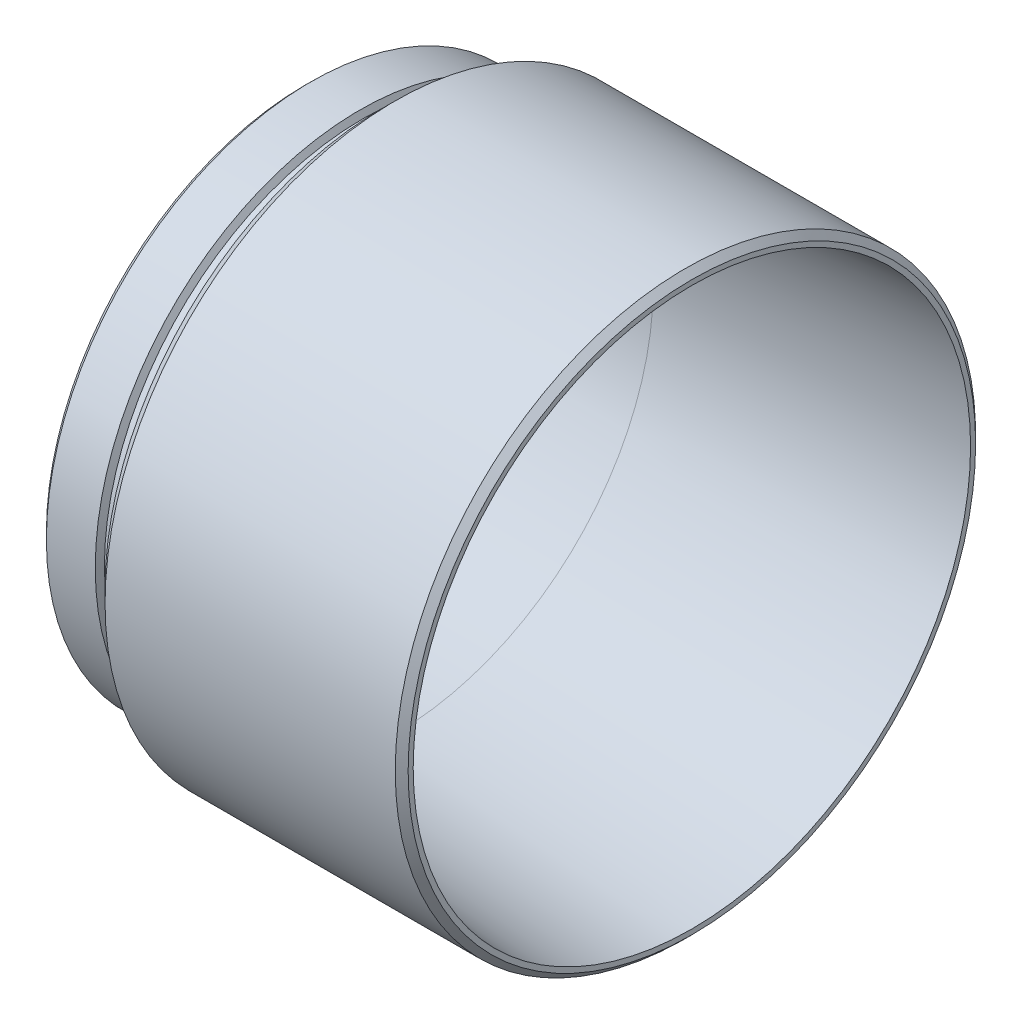
ISO-10303-21;
HEADER;
FILE_DESCRIPTION(('STEP AP214'),'2;1');
FILE_NAME('part.step','',(''),(''),'','','');
FILE_SCHEMA(('AUTOMOTIVE_DESIGN { 1 0 10303 214 1 1 1 1 }'));
ENDSEC;
DATA;
#1=APPLICATION_CONTEXT('core data for automotive mechanical design processes');
#2=APPLICATION_PROTOCOL_DEFINITION('international standard','automotive_design',2000,#1);
#3=PRODUCT_CONTEXT('',#1,'mechanical');
#4=PRODUCT('Part','Part','',(#3));
#5=PRODUCT_RELATED_PRODUCT_CATEGORY('part','',(#4));
#6=PRODUCT_DEFINITION_FORMATION('','',#4);
#7=PRODUCT_DEFINITION_CONTEXT('part definition',#1,'design');
#8=PRODUCT_DEFINITION('design','',#6,#7);
#9=PRODUCT_DEFINITION_SHAPE('','',#8);
#10=(LENGTH_UNIT() NAMED_UNIT(*) SI_UNIT(.MILLI.,.METRE.));
#11=(NAMED_UNIT(*) PLANE_ANGLE_UNIT() SI_UNIT($,.RADIAN.));
#12=(NAMED_UNIT(*) SI_UNIT($,.STERADIAN.) SOLID_ANGLE_UNIT());
#13=UNCERTAINTY_MEASURE_WITH_UNIT(LENGTH_MEASURE(1.E-05),#10,'distance_accuracy_value','');
#14=(GEOMETRIC_REPRESENTATION_CONTEXT(3) GLOBAL_UNCERTAINTY_ASSIGNED_CONTEXT((#13)) GLOBAL_UNIT_ASSIGNED_CONTEXT((#10,
#11,#12)) REPRESENTATION_CONTEXT('',''));
#15=CARTESIAN_POINT('',(0.,0.,0.));
#16=DIRECTION('',(0.,0.,1.));
#17=DIRECTION('',(1.,0.,0.));
#18=AXIS2_PLACEMENT_3D('',#15,#16,#17);
#19=CARTESIAN_POINT('',(2.,0.,0.));
#20=DIRECTION('',(1.,0.,0.));
#21=DIRECTION('',(0.,0.,-1.));
#22=AXIS2_PLACEMENT_3D('',#19,#20,#21);
#23=CONICAL_SURFACE('',#22,40.,0.0698131700797664);
#24=CARTESIAN_POINT('',(48.,0.,0.));
#25=DIRECTION('',(-1.,0.,0.));
#26=DIRECTION('',(0.,0.,1.));
#27=AXIS2_PLACEMENT_3D('',#24,#25,#26);
#28=CIRCLE('',#27,43.2166333494012);
#29=CARTESIAN_POINT('',(48.,0.,43.2166333494012));
#30=VERTEX_POINT('',#29);
#31=EDGE_CURVE('E10',#30,#30,#28,.T.);
#32=ORIENTED_EDGE('',*,*,#31,.F.);
#33=EDGE_LOOP('',(#32));
#34=FACE_BOUND('',#33,.T.);
#35=CARTESIAN_POINT('',(2.,0.,0.));
#36=DIRECTION('',(-1.,0.,0.));
#37=DIRECTION('',(0.,0.,1.));
#38=AXIS2_PLACEMENT_3D('',#35,#36,#37);
#39=CIRCLE('',#38,40.);
#40=CARTESIAN_POINT('',(2.,0.,40.));
#41=VERTEX_POINT('',#40);
#42=EDGE_CURVE('E91',#41,#41,#39,.T.);
#43=ORIENTED_EDGE('',*,*,#42,.T.);
#44=EDGE_LOOP('',(#43));
#45=FACE_BOUND('',#44,.T.);
#46=ADVANCED_FACE('F36',(#34,#45),#23,.F.);
#47=CARTESIAN_POINT('',(48.,0.,-44.));
#48=DIRECTION('',(-1.,0.,0.));
#49=DIRECTION('',(0.,0.,1.));
#50=AXIS2_PLACEMENT_3D('',#47,#48,#49);
#51=PLANE('',#50);
#52=CARTESIAN_POINT('',(48.,0.,0.));
#53=DIRECTION('',(-1.,0.,0.));
#54=DIRECTION('',(0.,0.,1.));
#55=AXIS2_PLACEMENT_3D('',#52,#53,#54);
#56=CIRCLE('',#55,44.);
#57=CARTESIAN_POINT('',(48.,0.,44.));
#58=VERTEX_POINT('',#57);
#59=EDGE_CURVE('E43',#58,#58,#56,.T.);
#60=ORIENTED_EDGE('',*,*,#59,.F.);
#61=EDGE_LOOP('',(#60));
#62=FACE_BOUND('',#61,.T.);
#63=ORIENTED_EDGE('',*,*,#31,.T.);
#64=EDGE_LOOP('',(#63));
#65=FACE_BOUND('',#64,.T.);
#66=ADVANCED_FACE('F159',(#62,#65),#51,.F.);
#67=CARTESIAN_POINT('',(48.,0.,0.));
#68=DIRECTION('',(-1.,0.,0.));
#69=DIRECTION('',(0.,0.,1.));
#70=AXIS2_PLACEMENT_3D('',#67,#68,#69);
#71=CONICAL_SURFACE('',#70,44.,0.785398163397445);
#72=CARTESIAN_POINT('',(47.,0.,0.));
#73=DIRECTION('',(-1.,0.,0.));
#74=DIRECTION('',(0.,0.,1.));
#75=AXIS2_PLACEMENT_3D('',#72,#73,#74);
#76=CIRCLE('',#75,45.);
#77=CARTESIAN_POINT('',(47.,0.,45.));
#78=VERTEX_POINT('',#77);
#79=EDGE_CURVE('E49',#78,#78,#76,.T.);
#80=ORIENTED_EDGE('',*,*,#79,.F.);
#81=EDGE_LOOP('',(#80));
#82=FACE_BOUND('',#81,.T.);
#83=ORIENTED_EDGE('',*,*,#59,.T.);
#84=EDGE_LOOP('',(#83));
#85=FACE_BOUND('',#84,.T.);
#86=ADVANCED_FACE('F154',(#82,#85),#71,.T.);
#87=CARTESIAN_POINT('',(-32.0942604393791,0.,0.));
#88=DIRECTION('',(-1.,0.,0.));
#89=DIRECTION('',(0.,0.,1.));
#90=AXIS2_PLACEMENT_3D('',#87,#88,#89);
#91=CYLINDRICAL_SURFACE('',#90,45.);
#92=CARTESIAN_POINT('',(2.,0.,0.));
#93=DIRECTION('',(-1.,0.,0.));
#94=DIRECTION('',(0.,0.,1.));
#95=AXIS2_PLACEMENT_3D('',#92,#93,#94);
#96=CIRCLE('',#95,45.);
#97=CARTESIAN_POINT('',(2.,0.,45.));
#98=VERTEX_POINT('',#97);
#99=EDGE_CURVE('E56',#98,#98,#96,.T.);
#100=ORIENTED_EDGE('',*,*,#99,.F.);
#101=EDGE_LOOP('',(#100));
#102=FACE_BOUND('',#101,.T.);
#103=ORIENTED_EDGE('',*,*,#79,.T.);
#104=EDGE_LOOP('',(#103));
#105=FACE_BOUND('',#104,.T.);
#106=ADVANCED_FACE('F148',(#102,#105),#91,.T.);
#107=CARTESIAN_POINT('',(2.,0.,0.));
#108=DIRECTION('',(1.,0.,0.));
#109=DIRECTION('',(0.,0.,-1.));
#110=AXIS2_PLACEMENT_3D('',#107,#108,#109);
#111=CONICAL_SURFACE('',#110,45.,0.785398163397448);
#112=CARTESIAN_POINT('',(0.,0.,0.));
#113=DIRECTION('',(-1.,0.,0.));
#114=DIRECTION('',(0.,0.,1.));
#115=AXIS2_PLACEMENT_3D('',#112,#113,#114);
#116=CIRCLE('',#115,43.);
#117=CARTESIAN_POINT('',(0.,0.,43.));
#118=VERTEX_POINT('',#117);
#119=EDGE_CURVE('E62',#118,#118,#116,.T.);
#120=ORIENTED_EDGE('',*,*,#119,.F.);
#121=EDGE_LOOP('',(#120));
#122=FACE_BOUND('',#121,.T.);
#123=ORIENTED_EDGE('',*,*,#99,.T.);
#124=EDGE_LOOP('',(#123));
#125=FACE_BOUND('',#124,.T.);
#126=ADVANCED_FACE('F142',(#122,#125),#111,.T.);
#127=CARTESIAN_POINT('',(0.,0.,-40.6));
#128=DIRECTION('',(1.,0.,0.));
#129=DIRECTION('',(0.,0.,-1.));
#130=AXIS2_PLACEMENT_3D('',#127,#128,#129);
#131=PLANE('',#130);
#132=CARTESIAN_POINT('',(0.,0.,0.));
#133=DIRECTION('',(-1.,0.,0.));
#134=DIRECTION('',(0.,0.,1.));
#135=AXIS2_PLACEMENT_3D('',#132,#133,#134);
#136=CIRCLE('',#135,40.6);
#137=CARTESIAN_POINT('',(0.,0.,40.6));
#138=VERTEX_POINT('',#137);
#139=EDGE_CURVE('E66',#138,#138,#136,.T.);
#140=ORIENTED_EDGE('',*,*,#139,.F.);
#141=EDGE_LOOP('',(#140));
#142=FACE_BOUND('',#141,.T.);
#143=ORIENTED_EDGE('',*,*,#119,.T.);
#144=EDGE_LOOP('',(#143));
#145=FACE_BOUND('',#144,.T.);
#146=ADVANCED_FACE('F136',(#142,#145),#131,.F.);
#147=CARTESIAN_POINT('',(-0.5,0.,0.));
#148=DIRECTION('',(-1.,0.,0.));
#149=DIRECTION('',(0.,0.,1.));
#150=AXIS2_PLACEMENT_3D('',#147,#148,#149);
#151=TOROIDAL_SURFACE('',#150,40.6,0.5);
#152=CARTESIAN_POINT('',(-0.5,0.,0.));
#153=DIRECTION('',(-1.,0.,0.));
#154=DIRECTION('',(0.,0.,1.));
#155=AXIS2_PLACEMENT_3D('',#152,#153,#154);
#156=CIRCLE('',#155,40.1);
#157=CARTESIAN_POINT('',(-0.5,0.,40.1));
#158=VERTEX_POINT('',#157);
#159=EDGE_CURVE('E69',#158,#158,#156,.T.);
#160=ORIENTED_EDGE('',*,*,#159,.F.);
#161=EDGE_LOOP('',(#160));
#162=FACE_BOUND('',#161,.T.);
#163=ORIENTED_EDGE('',*,*,#139,.T.);
#164=EDGE_LOOP('',(#163));
#165=FACE_BOUND('',#164,.T.);
#166=ADVANCED_FACE('F130',(#162,#165),#151,.F.);
#167=CARTESIAN_POINT('',(-32.0942604393791,0.,0.));
#168=DIRECTION('',(-1.,0.,0.));
#169=DIRECTION('',(0.,0.,1.));
#170=AXIS2_PLACEMENT_3D('',#167,#168,#169);
#171=CYLINDRICAL_SURFACE('',#170,40.1);
#172=CARTESIAN_POINT('',(-3.,0.,0.));
#173=DIRECTION('',(-1.,0.,0.));
#174=DIRECTION('',(0.,0.,1.));
#175=AXIS2_PLACEMENT_3D('',#172,#173,#174);
#176=CIRCLE('',#175,40.1);
#177=CARTESIAN_POINT('',(-3.,0.,40.1));
#178=VERTEX_POINT('',#177);
#179=EDGE_CURVE('E73',#178,#178,#176,.T.);
#180=ORIENTED_EDGE('',*,*,#179,.F.);
#181=EDGE_LOOP('',(#180));
#182=FACE_BOUND('',#181,.T.);
#183=ORIENTED_EDGE('',*,*,#159,.T.);
#184=EDGE_LOOP('',(#183));
#185=FACE_BOUND('',#184,.T.);
#186=ADVANCED_FACE('F124',(#182,#185),#171,.T.);
#187=CARTESIAN_POINT('',(-3.,0.,0.));
#188=DIRECTION('',(-1.,0.,0.));
#189=DIRECTION('',(0.,0.,1.));
#190=AXIS2_PLACEMENT_3D('',#187,#188,#189);
#191=CONICAL_SURFACE('',#190,40.1,1.0471975511966);
#192=CARTESIAN_POINT('',(-3.51961524227066,0.,0.));
#193=DIRECTION('',(-1.,0.,0.));
#194=DIRECTION('',(0.,0.,1.));
#195=AXIS2_PLACEMENT_3D('',#192,#193,#194);
#196=CIRCLE('',#195,41.);
#197=CARTESIAN_POINT('',(-3.51961524227066,0.,41.));
#198=VERTEX_POINT('',#197);
#199=EDGE_CURVE('E77',#198,#198,#196,.T.);
#200=ORIENTED_EDGE('',*,*,#199,.F.);
#201=EDGE_LOOP('',(#200));
#202=FACE_BOUND('',#201,.T.);
#203=ORIENTED_EDGE('',*,*,#179,.T.);
#204=EDGE_LOOP('',(#203));
#205=FACE_BOUND('',#204,.T.);
#206=ADVANCED_FACE('F118',(#202,#205),#191,.T.);
#207=CARTESIAN_POINT('',(-32.0942604393791,0.,0.));
#208=DIRECTION('',(-1.,0.,0.));
#209=DIRECTION('',(0.,0.,1.));
#210=AXIS2_PLACEMENT_3D('',#207,#208,#209);
#211=CYLINDRICAL_SURFACE('',#210,41.);
#212=CARTESIAN_POINT('',(-11.1,0.,0.));
#213=DIRECTION('',(-1.,0.,0.));
#214=DIRECTION('',(0.,0.,1.));
#215=AXIS2_PLACEMENT_3D('',#212,#213,#214);
#216=CIRCLE('',#215,41.);
#217=CARTESIAN_POINT('',(-11.1,0.,41.));
#218=VERTEX_POINT('',#217);
#219=EDGE_CURVE('E81',#218,#218,#216,.T.);
#220=ORIENTED_EDGE('',*,*,#219,.F.);
#221=EDGE_LOOP('',(#220));
#222=FACE_BOUND('',#221,.T.);
#223=ORIENTED_EDGE('',*,*,#199,.T.);
#224=EDGE_LOOP('',(#223));
#225=FACE_BOUND('',#224,.T.);
#226=ADVANCED_FACE('F112',(#222,#225),#211,.T.);
#227=CARTESIAN_POINT('',(-11.1,0.,0.));
#228=DIRECTION('',(1.,0.,0.));
#229=DIRECTION('',(0.,0.,-1.));
#230=AXIS2_PLACEMENT_3D('',#227,#228,#229);
#231=CONICAL_SURFACE('',#230,41.,0.785398163397446);
#232=CARTESIAN_POINT('',(-12.,0.,0.));
#233=DIRECTION('',(-1.,0.,0.));
#234=DIRECTION('',(0.,0.,1.));
#235=AXIS2_PLACEMENT_3D('',#232,#233,#234);
#236=CIRCLE('',#235,40.1);
#237=CARTESIAN_POINT('',(-12.,0.,40.1));
#238=VERTEX_POINT('',#237);
#239=EDGE_CURVE('E85',#238,#238,#236,.T.);
#240=ORIENTED_EDGE('',*,*,#239,.F.);
#241=EDGE_LOOP('',(#240));
#242=FACE_BOUND('',#241,.T.);
#243=ORIENTED_EDGE('',*,*,#219,.T.);
#244=EDGE_LOOP('',(#243));
#245=FACE_BOUND('',#244,.T.);
#246=ADVANCED_FACE('F106',(#242,#245),#231,.T.);
#247=CARTESIAN_POINT('',(-12.,0.,-40.));
#248=DIRECTION('',(1.,0.,0.));
#249=DIRECTION('',(0.,0.,-1.));
#250=AXIS2_PLACEMENT_3D('',#247,#248,#249);
#251=PLANE('',#250);
#252=CARTESIAN_POINT('',(-12.,0.,0.));
#253=DIRECTION('',(-1.,0.,0.));
#254=DIRECTION('',(0.,0.,1.));
#255=AXIS2_PLACEMENT_3D('',#252,#253,#254);
#256=CIRCLE('',#255,40.);
#257=CARTESIAN_POINT('',(-12.,0.,40.));
#258=VERTEX_POINT('',#257);
#259=EDGE_CURVE('E88',#258,#258,#256,.T.);
#260=ORIENTED_EDGE('',*,*,#259,.F.);
#261=EDGE_LOOP('',(#260));
#262=FACE_BOUND('',#261,.T.);
#263=ORIENTED_EDGE('',*,*,#239,.T.);
#264=EDGE_LOOP('',(#263));
#265=FACE_BOUND('',#264,.T.);
#266=ADVANCED_FACE('F100',(#262,#265),#251,.F.);
#267=CARTESIAN_POINT('',(-32.0942604393791,0.,0.));
#268=DIRECTION('',(-1.,0.,0.));
#269=DIRECTION('',(0.,0.,1.));
#270=AXIS2_PLACEMENT_3D('',#267,#268,#269);
#271=CYLINDRICAL_SURFACE('',#270,40.);
#272=ORIENTED_EDGE('',*,*,#42,.F.);
#273=EDGE_LOOP('',(#272));
#274=FACE_BOUND('',#273,.T.);
#275=ORIENTED_EDGE('',*,*,#259,.T.);
#276=EDGE_LOOP('',(#275));
#277=FACE_BOUND('',#276,.T.);
#278=ADVANCED_FACE('F97',(#274,#277),#271,.F.);
#279=CLOSED_SHELL('',(#46,#66,#86,#106,#126,#146,#166,#186,#206,#226,#246,#266,#278));
#280=MANIFOLD_SOLID_BREP('B2',#279);
#281=ADVANCED_BREP_SHAPE_REPRESENTATION('',(#18,#280),#14);
#282=SHAPE_DEFINITION_REPRESENTATION(#9,#281);
ENDSEC;
END-ISO-10303-21;
